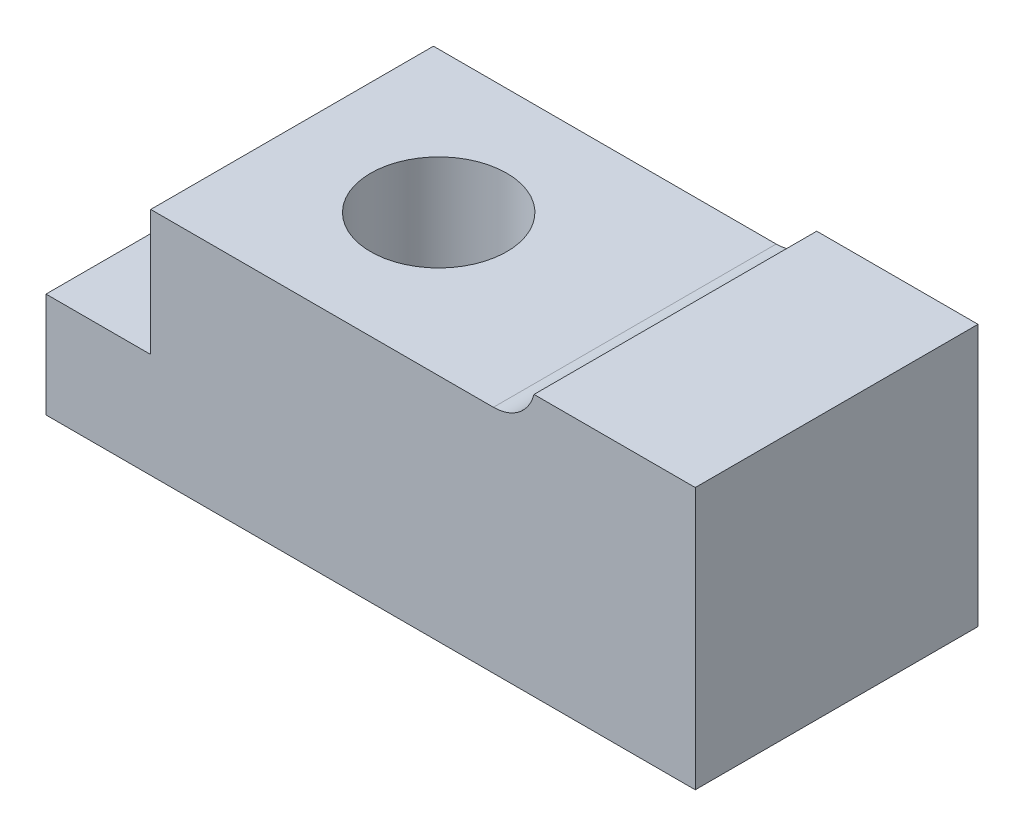
ISO-10303-21;
HEADER;
FILE_DESCRIPTION(('STEP AP214'),'2;1');
FILE_NAME('part.step','',(''),(''),'','','');
FILE_SCHEMA(('AUTOMOTIVE_DESIGN { 1 0 10303 214 1 1 1 1 }'));
ENDSEC;
DATA;
#1=APPLICATION_CONTEXT('core data for automotive mechanical design processes');
#2=APPLICATION_PROTOCOL_DEFINITION('international standard','automotive_design',2000,#1);
#3=PRODUCT_CONTEXT('',#1,'mechanical');
#4=PRODUCT('Part','Part','',(#3));
#5=PRODUCT_RELATED_PRODUCT_CATEGORY('part','',(#4));
#6=PRODUCT_DEFINITION_FORMATION('','',#4);
#7=PRODUCT_DEFINITION_CONTEXT('part definition',#1,'design');
#8=PRODUCT_DEFINITION('design','',#6,#7);
#9=PRODUCT_DEFINITION_SHAPE('','',#8);
#10=(LENGTH_UNIT() NAMED_UNIT(*) SI_UNIT(.MILLI.,.METRE.));
#11=(NAMED_UNIT(*) PLANE_ANGLE_UNIT() SI_UNIT($,.RADIAN.));
#12=(NAMED_UNIT(*) SI_UNIT($,.STERADIAN.) SOLID_ANGLE_UNIT());
#13=UNCERTAINTY_MEASURE_WITH_UNIT(LENGTH_MEASURE(1.E-05),#10,'distance_accuracy_value','');
#14=(GEOMETRIC_REPRESENTATION_CONTEXT(3) GLOBAL_UNCERTAINTY_ASSIGNED_CONTEXT((#13)) GLOBAL_UNIT_ASSIGNED_CONTEXT((#10,
#11,#12)) REPRESENTATION_CONTEXT('',''));
#15=CARTESIAN_POINT('',(0.,0.,0.));
#16=DIRECTION('',(0.,0.,1.));
#17=DIRECTION('',(1.,0.,0.));
#18=AXIS2_PLACEMENT_3D('',#15,#16,#17);
#19=CARTESIAN_POINT('',(-7.,25.,6.7766972589034E-12));
#20=DIRECTION('',(0.,-1.,-5.40956168748608E-13));
#21=DIRECTION('',(0.,5.40956168748608E-13,-1.));
#22=AXIS2_PLACEMENT_3D('',#19,#20,#21);
#23=CYLINDRICAL_SURFACE('',#22,6.5);
#24=CARTESIAN_POINT('',(-7.,22.,5.15382875265757E-12));
#25=DIRECTION('',(0.,-1.,-5.40956168748608E-13));
#26=DIRECTION('',(0.,5.40956168748608E-13,-1.));
#27=AXIS2_PLACEMENT_3D('',#24,#25,#26);
#28=CIRCLE('',#27,6.5);
#29=CARTESIAN_POINT('',(-7.,22.0000000000035,-6.49999999999485));
#30=VERTEX_POINT('',#29);
#31=EDGE_CURVE('E659',#30,#30,#28,.T.);
#32=ORIENTED_EDGE('',*,*,#31,.F.);
#33=EDGE_LOOP('',(#32));
#34=FACE_BOUND('',#33,.T.);
#35=CARTESIAN_POINT('',(-7.,12.,-2.55732934828503E-13));
#36=DIRECTION('',(0.,-1.,-5.40956168748608E-13));
#37=DIRECTION('',(0.,5.40956168748608E-13,-1.));
#38=AXIS2_PLACEMENT_3D('',#35,#36,#37);
#39=CIRCLE('',#38,6.5);
#40=CARTESIAN_POINT('',(-7.,12.0000000000035,-6.50000000000026));
#41=VERTEX_POINT('',#40);
#42=EDGE_CURVE('E488',#41,#41,#39,.F.);
#43=ORIENTED_EDGE('',*,*,#42,.F.);
#44=EDGE_LOOP('',(#43));
#45=FACE_BOUND('',#44,.T.);
#46=ADVANCED_FACE('F484',(#34,#45),#23,.F.);
#47=CARTESIAN_POINT('',(-31.,-7.2997163869104E-12,13.4999999999932));
#48=DIRECTION('',(1.,0.,0.));
#49=DIRECTION('',(0.,-5.40956168748608E-13,1.));
#50=AXIS2_PLACEMENT_3D('',#47,#48,#49);
#51=PLANE('',#50);
#52=DIRECTION('',(0.,1.,5.40956168748608E-13));
#53=VECTOR('',#52,1.);
#54=CARTESIAN_POINT('',(-31.,-7.2997163869104E-12,13.4999999999932));
#55=LINE('',#54,#53);
#56=CARTESIAN_POINT('',(-31.,-7.2997163869104E-12,13.4999999999932));
#57=VERTEX_POINT('',#56);
#58=CARTESIAN_POINT('',(-31.,9.9999999999927,13.4999999999987));
#59=VERTEX_POINT('',#58);
#60=EDGE_CURVE('E647',#57,#59,#55,.T.);
#61=ORIENTED_EDGE('',*,*,#60,.T.);
#62=DIRECTION('',(0.,5.40956168748608E-13,-1.));
#63=VECTOR('',#62,1.);
#64=CARTESIAN_POINT('',(-31.,9.9999999999927,13.4999999999987));
#65=LINE('',#64,#63);
#66=CARTESIAN_POINT('',(-31.,10.0000000000073,-13.5000000000013));
#67=VERTEX_POINT('',#66);
#68=EDGE_CURVE('E622',#59,#67,#65,.T.);
#69=ORIENTED_EDGE('',*,*,#68,.T.);
#70=DIRECTION('',(0.,1.,5.40956168748608E-13));
#71=VECTOR('',#70,1.);
#72=CARTESIAN_POINT('',(-31.,7.30665528081431E-12,-13.5000000000068));
#73=LINE('',#72,#71);
#74=CARTESIAN_POINT('',(-31.,7.30665528081431E-12,-13.5000000000068));
#75=VERTEX_POINT('',#74);
#76=EDGE_CURVE('E13',#75,#67,#73,.T.);
#77=ORIENTED_EDGE('',*,*,#76,.F.);
#78=DIRECTION('',(0.,5.40956168748608E-13,-1.));
#79=VECTOR('',#78,1.);
#80=CARTESIAN_POINT('',(-31.,-7.2997163869104E-12,13.4999999999932));
#81=LINE('',#80,#79);
#82=EDGE_CURVE('E562',#57,#75,#81,.T.);
#83=ORIENTED_EDGE('',*,*,#82,.F.);
#84=EDGE_LOOP('',(#61,#69,#77,#83));
#85=FACE_BOUND('',#84,.T.);
#86=ADVANCED_FACE('F486',(#85),#51,.F.);
#87=CARTESIAN_POINT('',(31.,7.30665528081431E-12,-13.5000000000067));
#88=DIRECTION('',(0.,-5.40956168748608E-13,1.));
#89=DIRECTION('',(-1.,0.,0.));
#90=AXIS2_PLACEMENT_3D('',#87,#88,#89);
#91=PLANE('',#90);
#92=DIRECTION('',(-1.,0.,0.));
#93=VECTOR('',#92,1.);
#94=CARTESIAN_POINT('',(-21.,22.0000000000073,-13.4999999999948));
#95=LINE('',#94,#93);
#96=CARTESIAN_POINT('',(11.7270166537926,22.0000000000073,-13.4999999999948));
#97=VERTEX_POINT('',#96);
#98=CARTESIAN_POINT('',(-21.,22.0000000000073,-13.4999999999948));
#99=VERTEX_POINT('',#98);
#100=EDGE_CURVE('E617',#97,#99,#95,.T.);
#101=ORIENTED_EDGE('',*,*,#100,.F.);
#102=CARTESIAN_POINT('',(11.7270166537926,25.9999999999927,-13.4999999999927));
#103=DIRECTION('',(0.,-5.40956168748608E-13,1.));
#104=DIRECTION('',(0.,-1.,-5.40956168748608E-13));
#105=AXIS2_PLACEMENT_3D('',#102,#103,#104);
#106=CIRCLE('',#105,4.);
#107=CARTESIAN_POINT('',(15.6,24.9999999999927,-13.4999999999932));
#108=VERTEX_POINT('',#107);
#109=EDGE_CURVE('E584',#97,#108,#106,.T.);
#110=ORIENTED_EDGE('',*,*,#109,.T.);
#111=DIRECTION('',(1.,0.,0.));
#112=VECTOR('',#111,1.);
#113=CARTESIAN_POINT('',(31.,25.0000000000073,-13.4999999999932));
#114=LINE('',#113,#112);
#115=CARTESIAN_POINT('',(31.,25.0000000000073,-13.4999999999932));
#116=VERTEX_POINT('',#115);
#117=EDGE_CURVE('E568',#108,#116,#114,.T.);
#118=ORIENTED_EDGE('',*,*,#117,.T.);
#119=DIRECTION('',(0.,1.,5.40956168748608E-13));
#120=VECTOR('',#119,1.);
#121=CARTESIAN_POINT('',(31.,7.30665528081431E-12,-13.5000000000067));
#122=LINE('',#121,#120);
#123=CARTESIAN_POINT('',(31.,7.30665528081431E-12,-13.5000000000067));
#124=VERTEX_POINT('',#123);
#125=EDGE_CURVE('E494',#124,#116,#122,.T.);
#126=ORIENTED_EDGE('',*,*,#125,.F.);
#127=DIRECTION('',(1.,0.,0.));
#128=VECTOR('',#127,1.);
#129=CARTESIAN_POINT('',(31.,7.30665528081431E-12,-13.5000000000067));
#130=LINE('',#129,#128);
#131=EDGE_CURVE('E638',#75,#124,#130,.T.);
#132=ORIENTED_EDGE('',*,*,#131,.F.);
#133=ORIENTED_EDGE('',*,*,#76,.T.);
#134=DIRECTION('',(-1.,0.,0.));
#135=VECTOR('',#134,1.);
#136=CARTESIAN_POINT('',(-31.,10.0000000000073,-13.5000000000013));
#137=LINE('',#136,#135);
#138=CARTESIAN_POINT('',(-21.,10.0000000000073,-13.5000000000013));
#139=VERTEX_POINT('',#138);
#140=EDGE_CURVE('E599',#139,#67,#137,.T.);
#141=ORIENTED_EDGE('',*,*,#140,.F.);
#142=DIRECTION('',(0.,-1.,-5.40956168748608E-13));
#143=VECTOR('',#142,1.);
#144=CARTESIAN_POINT('',(-21.,22.0000000000073,-13.4999999999948));
#145=LINE('',#144,#143);
#146=EDGE_CURVE('E612',#99,#139,#145,.T.);
#147=ORIENTED_EDGE('',*,*,#146,.F.);
#148=EDGE_LOOP('',(#101,#110,#118,#126,#132,#133,#141,#147));
#149=FACE_BOUND('',#148,.T.);
#150=ADVANCED_FACE('F707',(#149),#91,.F.);
#151=CARTESIAN_POINT('',(31.,-7.2997163869104E-12,13.4999999999933));
#152=DIRECTION('',(-1.,0.,0.));
#153=DIRECTION('',(0.,5.40956168748608E-13,-1.));
#154=AXIS2_PLACEMENT_3D('',#151,#152,#153);
#155=PLANE('',#154);
#156=DIRECTION('',(0.,-5.40956168748608E-13,1.));
#157=VECTOR('',#156,1.);
#158=CARTESIAN_POINT('',(31.,24.9999999999927,13.5000000000068));
#159=LINE('',#158,#157);
#160=CARTESIAN_POINT('',(31.,24.9999999999927,13.5000000000068));
#161=VERTEX_POINT('',#160);
#162=EDGE_CURVE('E563',#116,#161,#159,.T.);
#163=ORIENTED_EDGE('',*,*,#162,.T.);
#164=DIRECTION('',(0.,1.,5.40956168748608E-13));
#165=VECTOR('',#164,1.);
#166=CARTESIAN_POINT('',(31.,-7.2997163869104E-12,13.4999999999933));
#167=LINE('',#166,#165);
#168=CARTESIAN_POINT('',(31.,-7.2997163869104E-12,13.4999999999933));
#169=VERTEX_POINT('',#168);
#170=EDGE_CURVE('E558',#169,#161,#167,.T.);
#171=ORIENTED_EDGE('',*,*,#170,.F.);
#172=DIRECTION('',(0.,-5.40956168748608E-13,1.));
#173=VECTOR('',#172,1.);
#174=CARTESIAN_POINT('',(31.,-7.2997163869104E-12,13.4999999999933));
#175=LINE('',#174,#173);
#176=EDGE_CURVE('E641',#124,#169,#175,.T.);
#177=ORIENTED_EDGE('',*,*,#176,.F.);
#178=ORIENTED_EDGE('',*,*,#125,.T.);
#179=EDGE_LOOP('',(#163,#171,#177,#178));
#180=FACE_BOUND('',#179,.T.);
#181=ADVANCED_FACE('F711',(#180),#155,.F.);
#182=CARTESIAN_POINT('',(31.,-7.2997163869104E-12,13.4999999999933));
#183=DIRECTION('',(0.,5.40956168748608E-13,-1.));
#184=DIRECTION('',(1.,0.,0.));
#185=AXIS2_PLACEMENT_3D('',#182,#183,#184);
#186=PLANE('',#185);
#187=CARTESIAN_POINT('',(11.7270166537926,25.9999999999927,13.4999999999932));
#188=DIRECTION('',(0.,0.,-1.));
#189=DIRECTION('',(1.,0.,0.));
#190=AXIS2_PLACEMENT_3D('',#187,#188,#189);
#191=CIRCLE('',#190,4.);
#192=CARTESIAN_POINT('',(15.6,24.9999999999927,13.4999999999932));
#193=VERTEX_POINT('',#192);
#194=CARTESIAN_POINT('',(11.7270166537926,21.9999999999927,13.5000000000052));
#195=VERTEX_POINT('',#194);
#196=EDGE_CURVE('E555',#193,#195,#191,.T.);
#197=ORIENTED_EDGE('',*,*,#196,.T.);
#198=DIRECTION('',(-1.,0.,0.));
#199=VECTOR('',#198,1.);
#200=CARTESIAN_POINT('',(-21.,21.9999999999927,13.5000000000052));
#201=LINE('',#200,#199);
#202=CARTESIAN_POINT('',(-21.,21.9999999999927,13.5000000000052));
#203=VERTEX_POINT('',#202);
#204=EDGE_CURVE('E502',#195,#203,#201,.T.);
#205=ORIENTED_EDGE('',*,*,#204,.T.);
#206=DIRECTION('',(0.,-1.,-5.40956168748608E-13));
#207=VECTOR('',#206,1.);
#208=CARTESIAN_POINT('',(-21.,21.9999999999927,13.5000000000052));
#209=LINE('',#208,#207);
#210=CARTESIAN_POINT('',(-21.,9.9999999999927,13.4999999999987));
#211=VERTEX_POINT('',#210);
#212=EDGE_CURVE('E598',#203,#211,#209,.T.);
#213=ORIENTED_EDGE('',*,*,#212,.T.);
#214=DIRECTION('',(-1.,0.,0.));
#215=VECTOR('',#214,1.);
#216=CARTESIAN_POINT('',(-31.,9.9999999999927,13.4999999999987));
#217=LINE('',#216,#215);
#218=EDGE_CURVE('E605',#211,#59,#217,.T.);
#219=ORIENTED_EDGE('',*,*,#218,.T.);
#220=ORIENTED_EDGE('',*,*,#60,.F.);
#221=DIRECTION('',(-1.,0.,0.));
#222=VECTOR('',#221,1.);
#223=CARTESIAN_POINT('',(31.,-7.2997163869104E-12,13.4999999999933));
#224=LINE('',#223,#222);
#225=EDGE_CURVE('E644',#169,#57,#224,.T.);
#226=ORIENTED_EDGE('',*,*,#225,.F.);
#227=ORIENTED_EDGE('',*,*,#170,.T.);
#228=DIRECTION('',(-1.,0.,0.));
#229=VECTOR('',#228,1.);
#230=CARTESIAN_POINT('',(31.,24.9999999999927,13.5000000000068));
#231=LINE('',#230,#229);
#232=EDGE_CURVE('E551',#161,#193,#231,.T.);
#233=ORIENTED_EDGE('',*,*,#232,.T.);
#234=EDGE_LOOP('',(#197,#205,#213,#219,#220,#226,#227,#233));
#235=FACE_BOUND('',#234,.T.);
#236=ADVANCED_FACE('F553',(#235),#186,.F.);
#237=CARTESIAN_POINT('',(0.,0.,-6.74720695981179E-12));
#238=DIRECTION('',(0.,1.,5.40956168748608E-13));
#239=DIRECTION('',(0.,-5.40956168748608E-13,1.));
#240=AXIS2_PLACEMENT_3D('',#237,#238,#239);
#241=PLANE('',#240);
#242=CARTESIAN_POINT('',(-7.,0.,-6.74720695981179E-12));
#243=DIRECTION('',(0.,-1.,-5.40956168748608E-13));
#244=DIRECTION('',(0.,5.40956168748608E-13,-1.));
#245=AXIS2_PLACEMENT_3D('',#242,#243,#244);
#246=CIRCLE('',#245,9.5);
#247=CARTESIAN_POINT('',(-7.,5.13908360311542E-12,-9.50000000000675));
#248=VERTEX_POINT('',#247);
#249=EDGE_CURVE('E686',#248,#248,#246,.T.);
#250=ORIENTED_EDGE('',*,*,#249,.F.);
#251=EDGE_LOOP('',(#250));
#252=FACE_BOUND('',#251,.T.);
#253=ORIENTED_EDGE('',*,*,#82,.T.);
#254=ORIENTED_EDGE('',*,*,#131,.T.);
#255=ORIENTED_EDGE('',*,*,#176,.T.);
#256=ORIENTED_EDGE('',*,*,#225,.T.);
#257=EDGE_LOOP('',(#253,#254,#255,#256));
#258=FACE_BOUND('',#257,.T.);
#259=ADVANCED_FACE('F696',(#252,#258),#241,.F.);
#260=CARTESIAN_POINT('',(0.,25.,6.7766972589034E-12));
#261=DIRECTION('',(0.,1.,5.40956168748608E-13));
#262=DIRECTION('',(0.,-5.40956168748608E-13,1.));
#263=AXIS2_PLACEMENT_3D('',#260,#261,#262);
#264=PLANE('',#263);
#265=ORIENTED_EDGE('',*,*,#117,.F.);
#266=DIRECTION('',(0.,0.,1.));
#267=VECTOR('',#266,1.);
#268=CARTESIAN_POINT('',(15.6,24.9999999999927,-25.7576577537782));
#269=LINE('',#268,#267);
#270=EDGE_CURVE('E566',#108,#193,#269,.T.);
#271=ORIENTED_EDGE('',*,*,#270,.T.);
#272=ORIENTED_EDGE('',*,*,#232,.F.);
#273=ORIENTED_EDGE('',*,*,#162,.F.);
#274=EDGE_LOOP('',(#265,#271,#272,#273));
#275=FACE_BOUND('',#274,.T.);
#276=ADVANCED_FACE('F567',(#275),#264,.T.);
#277=CARTESIAN_POINT('',(-31.,9.9999999999927,13.4999999999987));
#278=DIRECTION('',(0.,-1.,-5.40956168748608E-13));
#279=DIRECTION('',(0.,5.40956168748608E-13,-1.));
#280=AXIS2_PLACEMENT_3D('',#277,#278,#279);
#281=PLANE('',#280);
#282=ORIENTED_EDGE('',*,*,#140,.T.);
#283=ORIENTED_EDGE('',*,*,#68,.F.);
#284=ORIENTED_EDGE('',*,*,#218,.F.);
#285=DIRECTION('',(0.,5.40956168748608E-13,-1.));
#286=VECTOR('',#285,1.);
#287=CARTESIAN_POINT('',(-21.,9.9999999999927,13.4999999999987));
#288=LINE('',#287,#286);
#289=EDGE_CURVE('E633',#211,#139,#288,.T.);
#290=ORIENTED_EDGE('',*,*,#289,.T.);
#291=EDGE_LOOP('',(#282,#283,#284,#290));
#292=FACE_BOUND('',#291,.T.);
#293=ADVANCED_FACE('F772',(#292),#281,.F.);
#294=CARTESIAN_POINT('',(-21.,21.9999999999927,13.5000000000052));
#295=DIRECTION('',(1.,0.,0.));
#296=DIRECTION('',(0.,-5.40956168748608E-13,1.));
#297=AXIS2_PLACEMENT_3D('',#294,#295,#296);
#298=PLANE('',#297);
#299=ORIENTED_EDGE('',*,*,#146,.T.);
#300=ORIENTED_EDGE('',*,*,#289,.F.);
#301=ORIENTED_EDGE('',*,*,#212,.F.);
#302=DIRECTION('',(0.,5.40956168748608E-13,-1.));
#303=VECTOR('',#302,1.);
#304=CARTESIAN_POINT('',(-21.,21.9999999999927,13.5000000000052));
#305=LINE('',#304,#303);
#306=EDGE_CURVE('E628',#203,#99,#305,.T.);
#307=ORIENTED_EDGE('',*,*,#306,.T.);
#308=EDGE_LOOP('',(#299,#300,#301,#307));
#309=FACE_BOUND('',#308,.T.);
#310=ADVANCED_FACE('F778',(#309),#298,.F.);
#311=CARTESIAN_POINT('',(-21.,21.9999999999927,13.5000000000052));
#312=DIRECTION('',(0.,-1.,-5.40956168748608E-13));
#313=DIRECTION('',(0.,5.40956168748608E-13,-1.));
#314=AXIS2_PLACEMENT_3D('',#311,#312,#313);
#315=PLANE('',#314);
#316=ORIENTED_EDGE('',*,*,#31,.T.);
#317=EDGE_LOOP('',(#316));
#318=FACE_BOUND('',#317,.T.);
#319=ORIENTED_EDGE('',*,*,#204,.F.);
#320=DIRECTION('',(0.,0.,1.));
#321=VECTOR('',#320,1.);
#322=CARTESIAN_POINT('',(11.7270166537926,21.9999999999927,-25.7576577537782));
#323=LINE('',#322,#321);
#324=EDGE_CURVE('E506',#97,#195,#323,.T.);
#325=ORIENTED_EDGE('',*,*,#324,.F.);
#326=ORIENTED_EDGE('',*,*,#100,.T.);
#327=ORIENTED_EDGE('',*,*,#306,.F.);
#328=EDGE_LOOP('',(#319,#325,#326,#327));
#329=FACE_BOUND('',#328,.T.);
#330=ADVANCED_FACE('F767',(#318,#329),#315,.F.);
#331=CARTESIAN_POINT('',(11.7270166537926,25.9999999999927,-25.7576577537782));
#332=DIRECTION('',(0.,0.,1.));
#333=DIRECTION('',(1.,0.,0.));
#334=AXIS2_PLACEMENT_3D('',#331,#332,#333);
#335=CYLINDRICAL_SURFACE('',#334,4.);
#336=ORIENTED_EDGE('',*,*,#109,.F.);
#337=ORIENTED_EDGE('',*,*,#324,.T.);
#338=ORIENTED_EDGE('',*,*,#196,.F.);
#339=ORIENTED_EDGE('',*,*,#270,.F.);
#340=EDGE_LOOP('',(#336,#337,#338,#339));
#341=FACE_BOUND('',#340,.T.);
#342=ADVANCED_FACE('F573',(#341),#335,.F.);
#343=CARTESIAN_POINT('',(-7.,12.,-2.55732934828503E-13));
#344=DIRECTION('',(0.,-1.,-5.40956168748608E-13));
#345=DIRECTION('',(0.,5.40956168748608E-13,-1.));
#346=AXIS2_PLACEMENT_3D('',#343,#344,#345);
#347=PLANE('',#346);
#348=CARTESIAN_POINT('',(-7.,12.,-2.55732934828503E-13));
#349=DIRECTION('',(0.,-1.,-5.40956168748608E-13));
#350=DIRECTION('',(0.,5.40956168748608E-13,-1.));
#351=AXIS2_PLACEMENT_3D('',#348,#349,#350);
#352=CIRCLE('',#351,9.5);
#353=CARTESIAN_POINT('',(-7.,12.0000000000051,-9.50000000000025));
#354=VERTEX_POINT('',#353);
#355=EDGE_CURVE('E580',#354,#354,#352,.T.);
#356=ORIENTED_EDGE('',*,*,#355,.T.);
#357=EDGE_LOOP('',(#356));
#358=FACE_BOUND('',#357,.T.);
#359=ORIENTED_EDGE('',*,*,#42,.T.);
#360=EDGE_LOOP('',(#359));
#361=FACE_BOUND('',#360,.T.);
#362=ADVANCED_FACE('F841',(#358,#361),#347,.T.);
#363=CARTESIAN_POINT('',(-7.,12.,-2.55732934828503E-13));
#364=DIRECTION('',(0.,-1.,-5.40956168748608E-13));
#365=DIRECTION('',(0.,5.40956168748608E-13,-1.));
#366=AXIS2_PLACEMENT_3D('',#363,#364,#365);
#367=CYLINDRICAL_SURFACE('',#366,9.5);
#368=ORIENTED_EDGE('',*,*,#355,.F.);
#369=EDGE_LOOP('',(#368));
#370=FACE_BOUND('',#369,.T.);
#371=ORIENTED_EDGE('',*,*,#249,.T.);
#372=EDGE_LOOP('',(#371));
#373=FACE_BOUND('',#372,.T.);
#374=ADVANCED_FACE('F694',(#370,#373),#367,.F.);
#375=CLOSED_SHELL('',(#46,#86,#150,#181,#236,#259,#276,#293,#310,#330,#342,#362,#374));
#376=MANIFOLD_SOLID_BREP('B2',#375);
#377=ADVANCED_BREP_SHAPE_REPRESENTATION('',(#18,#376),#14);
#378=SHAPE_DEFINITION_REPRESENTATION(#9,#377);
ENDSEC;
END-ISO-10303-21;
